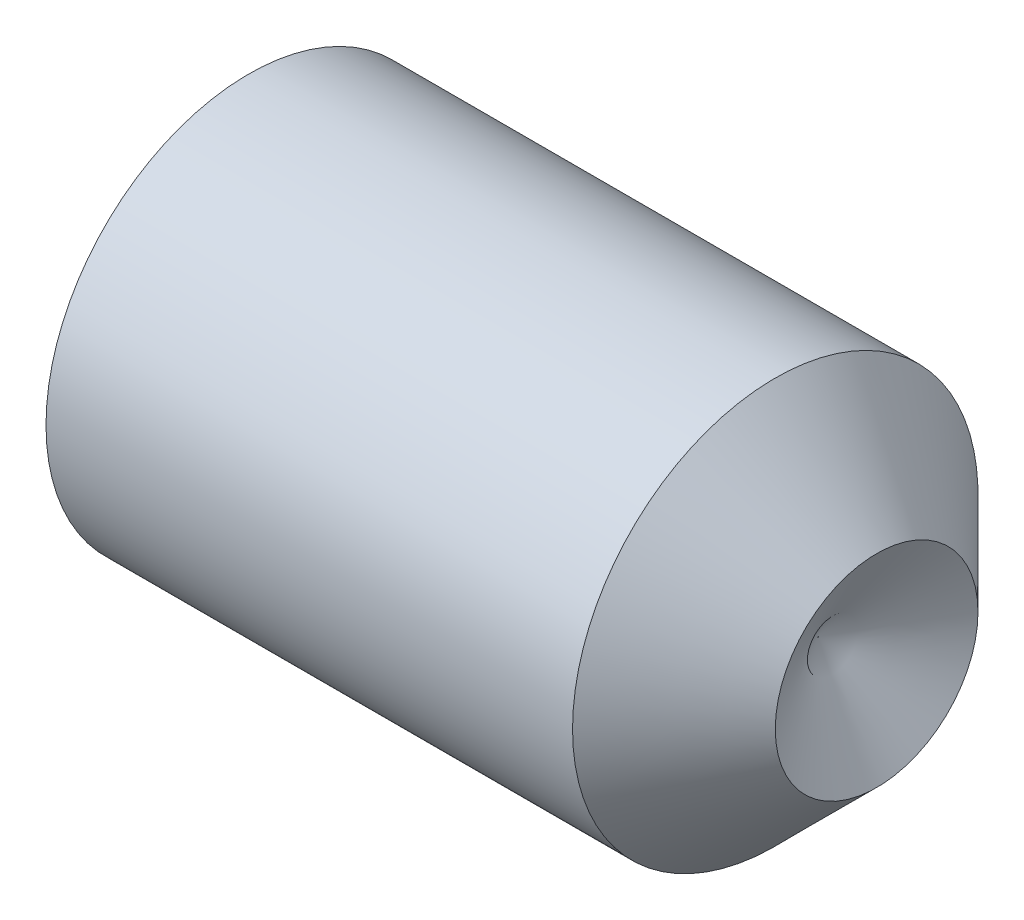
ISO-10303-21;
HEADER;
FILE_DESCRIPTION(('STEP AP214'),'2;1');
FILE_NAME('part.step','',(''),(''),'','','');
FILE_SCHEMA(('AUTOMOTIVE_DESIGN { 1 0 10303 214 1 1 1 1 }'));
ENDSEC;
DATA;
#1=APPLICATION_CONTEXT('core data for automotive mechanical design processes');
#2=APPLICATION_PROTOCOL_DEFINITION('international standard','automotive_design',2000,#1);
#3=PRODUCT_CONTEXT('',#1,'mechanical');
#4=PRODUCT('Part','Part','',(#3));
#5=PRODUCT_RELATED_PRODUCT_CATEGORY('part','',(#4));
#6=PRODUCT_DEFINITION_FORMATION('','',#4);
#7=PRODUCT_DEFINITION_CONTEXT('part definition',#1,'design');
#8=PRODUCT_DEFINITION('design','',#6,#7);
#9=PRODUCT_DEFINITION_SHAPE('','',#8);
#10=(LENGTH_UNIT() NAMED_UNIT(*) SI_UNIT(.MILLI.,.METRE.));
#11=(NAMED_UNIT(*) PLANE_ANGLE_UNIT() SI_UNIT($,.RADIAN.));
#12=(NAMED_UNIT(*) SI_UNIT($,.STERADIAN.) SOLID_ANGLE_UNIT());
#13=UNCERTAINTY_MEASURE_WITH_UNIT(LENGTH_MEASURE(1.E-05),#10,'distance_accuracy_value','');
#14=(GEOMETRIC_REPRESENTATION_CONTEXT(3) GLOBAL_UNCERTAINTY_ASSIGNED_CONTEXT((#13)) GLOBAL_UNIT_ASSIGNED_CONTEXT((#10,
#11,#12)) REPRESENTATION_CONTEXT('',''));
#15=CARTESIAN_POINT('',(0.,0.,0.));
#16=DIRECTION('',(0.,0.,1.));
#17=DIRECTION('',(1.,0.,0.));
#18=AXIS2_PLACEMENT_3D('',#15,#16,#17);
#19=CARTESIAN_POINT('',(0.,0.,0.));
#20=DIRECTION('',(-1.,0.,0.));
#21=DIRECTION('',(0.,0.,1.));
#22=AXIS2_PLACEMENT_3D('',#19,#20,#21);
#23=PLANE('',#22);
#24=CARTESIAN_POINT('',(0.,0.,0.));
#25=DIRECTION('',(-1.,0.,0.));
#26=DIRECTION('',(0.,0.,1.));
#27=AXIS2_PLACEMENT_3D('',#24,#25,#26);
#28=CIRCLE('',#27,2.055);
#29=CARTESIAN_POINT('',(0.,0.,2.055));
#30=VERTEX_POINT('',#29);
#31=EDGE_CURVE('E11',#30,#30,#28,.T.);
#32=ORIENTED_EDGE('',*,*,#31,.T.);
#33=EDGE_LOOP('',(#32));
#34=FACE_BOUND('',#33,.T.);
#35=DIRECTION('',(0.,0.,-1.));
#36=VECTOR('',#35,1.);
#37=CARTESIAN_POINT('',(0.,1.25,0.72168783648703));
#38=LINE('',#37,#36);
#39=CARTESIAN_POINT('',(0.,1.25,0.72168783648703));
#40=VERTEX_POINT('',#39);
#41=CARTESIAN_POINT('',(0.,1.25,-0.721687836487035));
#42=VERTEX_POINT('',#41);
#43=EDGE_CURVE('E95',#40,#42,#38,.T.);
#44=ORIENTED_EDGE('',*,*,#43,.F.);
#45=DIRECTION('',(0.,-0.866025403784439,0.5));
#46=VECTOR('',#45,1.);
#47=CARTESIAN_POINT('',(0.,1.25,0.72168783648703));
#48=LINE('',#47,#46);
#49=CARTESIAN_POINT('',(0.,0.,1.44337567297406));
#50=VERTEX_POINT('',#49);
#51=EDGE_CURVE('E48',#40,#50,#48,.T.);
#52=ORIENTED_EDGE('',*,*,#51,.T.);
#53=DIRECTION('',(0.,0.866025403784439,0.5));
#54=VECTOR('',#53,1.);
#55=CARTESIAN_POINT('',(0.,-1.25,0.72168783648703));
#56=LINE('',#55,#54);
#57=CARTESIAN_POINT('',(0.,-1.25,0.72168783648703));
#58=VERTEX_POINT('',#57);
#59=EDGE_CURVE('E101',#58,#50,#56,.T.);
#60=ORIENTED_EDGE('',*,*,#59,.F.);
#61=DIRECTION('',(0.,0.,-1.));
#62=VECTOR('',#61,1.);
#63=CARTESIAN_POINT('',(0.,-1.25,0.72168783648703));
#64=LINE('',#63,#62);
#65=CARTESIAN_POINT('',(0.,-1.25,-0.721687836487035));
#66=VERTEX_POINT('',#65);
#67=EDGE_CURVE('E121',#58,#66,#64,.T.);
#68=ORIENTED_EDGE('',*,*,#67,.T.);
#69=DIRECTION('',(0.,0.866025403784439,-0.5));
#70=VECTOR('',#69,1.);
#71=CARTESIAN_POINT('',(0.,-1.25,-0.721687836487035));
#72=LINE('',#71,#70);
#73=CARTESIAN_POINT('',(0.,0.,-1.44337567297407));
#74=VERTEX_POINT('',#73);
#75=EDGE_CURVE('E124',#66,#74,#72,.T.);
#76=ORIENTED_EDGE('',*,*,#75,.T.);
#77=DIRECTION('',(0.,-0.866025403784439,-0.5));
#78=VECTOR('',#77,1.);
#79=CARTESIAN_POINT('',(0.,1.25,-0.721687836487035));
#80=LINE('',#79,#78);
#81=EDGE_CURVE('E127',#42,#74,#80,.T.);
#82=ORIENTED_EDGE('',*,*,#81,.F.);
#83=EDGE_LOOP('',(#44,#52,#60,#68,#76,#82));
#84=FACE_BOUND('',#83,.T.);
#85=ADVANCED_FACE('F34',(#34,#84),#23,.T.);
#86=CARTESIAN_POINT('',(0.,0.,0.));
#87=DIRECTION('',(1.,0.,0.));
#88=DIRECTION('',(0.,0.,-1.));
#89=AXIS2_PLACEMENT_3D('',#86,#87,#88);
#90=CONICAL_SURFACE('',#89,2.055,1.0471975511966);
#91=CARTESIAN_POINT('',(0.256920869789384,0.,0.));
#92=DIRECTION('',(-1.,0.,0.));
#93=DIRECTION('',(0.,0.,1.));
#94=AXIS2_PLACEMENT_3D('',#91,#92,#93);
#95=CIRCLE('',#94,2.5);
#96=CARTESIAN_POINT('',(0.256920869789384,0.,2.5));
#97=VERTEX_POINT('',#96);
#98=EDGE_CURVE('E41',#97,#97,#95,.T.);
#99=ORIENTED_EDGE('',*,*,#98,.T.);
#100=EDGE_LOOP('',(#99));
#101=FACE_BOUND('',#100,.T.);
#102=ORIENTED_EDGE('',*,*,#31,.F.);
#103=EDGE_LOOP('',(#102));
#104=FACE_BOUND('',#103,.T.);
#105=ADVANCED_FACE('F147',(#101,#104),#90,.T.);
#106=CARTESIAN_POINT('',(-12.7,0.,0.));
#107=DIRECTION('',(-1.,0.,0.));
#108=DIRECTION('',(0.,0.,1.));
#109=AXIS2_PLACEMENT_3D('',#106,#107,#108);
#110=CYLINDRICAL_SURFACE('',#109,2.5);
#111=CARTESIAN_POINT('',(6.75000000000003,0.,0.));
#112=DIRECTION('',(-1.,0.,0.));
#113=DIRECTION('',(0.,0.,1.));
#114=AXIS2_PLACEMENT_3D('',#111,#112,#113);
#115=CIRCLE('',#114,2.5);
#116=CARTESIAN_POINT('',(6.75000000000003,0.,2.5));
#117=VERTEX_POINT('',#116);
#118=EDGE_CURVE('E142',#117,#117,#115,.T.);
#119=ORIENTED_EDGE('',*,*,#118,.T.);
#120=EDGE_LOOP('',(#119));
#121=FACE_BOUND('',#120,.T.);
#122=ORIENTED_EDGE('',*,*,#98,.F.);
#123=EDGE_LOOP('',(#122));
#124=FACE_BOUND('',#123,.T.);
#125=ADVANCED_FACE('F150',(#121,#124),#110,.T.);
#126=CARTESIAN_POINT('',(6.75000000000003,0.,0.));
#127=DIRECTION('',(-1.,0.,0.));
#128=DIRECTION('',(0.,0.,1.));
#129=AXIS2_PLACEMENT_3D('',#126,#127,#128);
#130=CONICAL_SURFACE('',#129,2.5,0.785398163397459);
#131=CARTESIAN_POINT('',(8.,0.,0.));
#132=DIRECTION('',(-1.,0.,0.));
#133=DIRECTION('',(0.,0.,1.));
#134=AXIS2_PLACEMENT_3D('',#131,#132,#133);
#135=CIRCLE('',#134,1.25);
#136=CARTESIAN_POINT('',(8.,0.,1.25));
#137=VERTEX_POINT('',#136);
#138=EDGE_CURVE('E102',#137,#137,#135,.T.);
#139=ORIENTED_EDGE('',*,*,#138,.T.);
#140=EDGE_LOOP('',(#139));
#141=FACE_BOUND('',#140,.T.);
#142=ORIENTED_EDGE('',*,*,#118,.F.);
#143=EDGE_LOOP('',(#142));
#144=FACE_BOUND('',#143,.T.);
#145=ADVANCED_FACE('F152',(#141,#144),#130,.T.);
#146=CARTESIAN_POINT('',(7.27831216351297,0.,0.));
#147=DIRECTION('',(1.,0.,0.));
#148=DIRECTION('',(0.,0.,-1.));
#149=AXIS2_PLACEMENT_3D('',#146,#147,#148);
#150=CONICAL_SURFACE('',#149,0.,1.0471975511966);
#151=ORIENTED_EDGE('',*,*,#138,.F.);
#152=EDGE_LOOP('',(#151));
#153=FACE_BOUND('',#152,.T.);
#154=CARTESIAN_POINT('',(7.27831216351297,0.,0.));
#155=VERTEX_POINT('',#154);
#156=VERTEX_LOOP('',#155);
#157=FACE_BOUND('',#156,.T.);
#158=ADVANCED_FACE('F159',(#153,#157),#150,.F.);
#159=CARTESIAN_POINT('',(3.,1.25,0.72168783648703));
#160=DIRECTION('',(0.,-0.5,-0.866025403784439));
#161=DIRECTION('',(0.,0.866025403784439,-0.5));
#162=AXIS2_PLACEMENT_3D('',#159,#160,#161);
#163=PLANE('',#162);
#164=ORIENTED_EDGE('',*,*,#51,.F.);
#165=DIRECTION('',(-1.,0.,0.));
#166=VECTOR('',#165,1.);
#167=CARTESIAN_POINT('',(3.,1.25,0.72168783648703));
#168=LINE('',#167,#166);
#169=CARTESIAN_POINT('',(3.,1.25,0.72168783648703));
#170=VERTEX_POINT('',#169);
#171=EDGE_CURVE('E89',#170,#40,#168,.T.);
#172=ORIENTED_EDGE('',*,*,#171,.F.);
#173=DIRECTION('',(0.,-0.866025403784439,0.5));
#174=VECTOR('',#173,1.);
#175=CARTESIAN_POINT('',(3.,1.25,0.72168783648703));
#176=LINE('',#175,#174);
#177=CARTESIAN_POINT('',(3.,0.,1.44337567297406));
#178=VERTEX_POINT('',#177);
#179=EDGE_CURVE('E84',#170,#178,#176,.T.);
#180=ORIENTED_EDGE('',*,*,#179,.T.);
#181=DIRECTION('',(-1.,0.,0.));
#182=VECTOR('',#181,1.);
#183=CARTESIAN_POINT('',(3.,0.,1.44337567297406));
#184=LINE('',#183,#182);
#185=EDGE_CURVE('E87',#178,#50,#184,.T.);
#186=ORIENTED_EDGE('',*,*,#185,.T.);
#187=EDGE_LOOP('',(#164,#172,#180,#186));
#188=FACE_BOUND('',#187,.T.);
#189=ADVANCED_FACE('F86',(#188),#163,.T.);
#190=CARTESIAN_POINT('',(3.,-1.25,0.72168783648703));
#191=DIRECTION('',(0.,-0.5,0.866025403784439));
#192=DIRECTION('',(0.,-0.866025403784439,-0.5));
#193=AXIS2_PLACEMENT_3D('',#190,#191,#192);
#194=PLANE('',#193);
#195=ORIENTED_EDGE('',*,*,#59,.T.);
#196=ORIENTED_EDGE('',*,*,#185,.F.);
#197=DIRECTION('',(0.,0.866025403784439,0.5));
#198=VECTOR('',#197,1.);
#199=CARTESIAN_POINT('',(3.,-1.25,0.72168783648703));
#200=LINE('',#199,#198);
#201=CARTESIAN_POINT('',(3.,-1.25,0.72168783648703));
#202=VERTEX_POINT('',#201);
#203=EDGE_CURVE('E94',#202,#178,#200,.T.);
#204=ORIENTED_EDGE('',*,*,#203,.F.);
#205=DIRECTION('',(-1.,0.,0.));
#206=VECTOR('',#205,1.);
#207=CARTESIAN_POINT('',(3.,-1.25,0.72168783648703));
#208=LINE('',#207,#206);
#209=EDGE_CURVE('E103',#202,#58,#208,.T.);
#210=ORIENTED_EDGE('',*,*,#209,.T.);
#211=EDGE_LOOP('',(#195,#196,#204,#210));
#212=FACE_BOUND('',#211,.T.);
#213=ADVANCED_FACE('F99',(#212),#194,.F.);
#214=CARTESIAN_POINT('',(3.,-1.25,0.72168783648703));
#215=DIRECTION('',(0.,1.,0.));
#216=DIRECTION('',(0.,0.,1.));
#217=AXIS2_PLACEMENT_3D('',#214,#215,#216);
#218=PLANE('',#217);
#219=ORIENTED_EDGE('',*,*,#67,.F.);
#220=ORIENTED_EDGE('',*,*,#209,.F.);
#221=DIRECTION('',(0.,0.,-1.));
#222=VECTOR('',#221,1.);
#223=CARTESIAN_POINT('',(3.,-1.25,0.72168783648703));
#224=LINE('',#223,#222);
#225=CARTESIAN_POINT('',(3.,-1.25,-0.721687836487035));
#226=VERTEX_POINT('',#225);
#227=EDGE_CURVE('E108',#202,#226,#224,.T.);
#228=ORIENTED_EDGE('',*,*,#227,.T.);
#229=DIRECTION('',(-1.,0.,0.));
#230=VECTOR('',#229,1.);
#231=CARTESIAN_POINT('',(3.,-1.25,-0.721687836487035));
#232=LINE('',#231,#230);
#233=EDGE_CURVE('E137',#226,#66,#232,.T.);
#234=ORIENTED_EDGE('',*,*,#233,.T.);
#235=EDGE_LOOP('',(#219,#220,#228,#234));
#236=FACE_BOUND('',#235,.T.);
#237=ADVANCED_FACE('F182',(#236),#218,.T.);
#238=CARTESIAN_POINT('',(3.,-1.25,-0.721687836487035));
#239=DIRECTION('',(0.,0.5,0.866025403784439));
#240=DIRECTION('',(0.,-0.866025403784439,0.5));
#241=AXIS2_PLACEMENT_3D('',#238,#239,#240);
#242=PLANE('',#241);
#243=ORIENTED_EDGE('',*,*,#75,.F.);
#244=ORIENTED_EDGE('',*,*,#233,.F.);
#245=DIRECTION('',(0.,0.866025403784439,-0.5));
#246=VECTOR('',#245,1.);
#247=CARTESIAN_POINT('',(3.,-1.25,-0.721687836487035));
#248=LINE('',#247,#246);
#249=CARTESIAN_POINT('',(3.,0.,-1.44337567297407));
#250=VERTEX_POINT('',#249);
#251=EDGE_CURVE('E110',#226,#250,#248,.T.);
#252=ORIENTED_EDGE('',*,*,#251,.T.);
#253=DIRECTION('',(-1.,0.,0.));
#254=VECTOR('',#253,1.);
#255=CARTESIAN_POINT('',(3.,0.,-1.44337567297407));
#256=LINE('',#255,#254);
#257=EDGE_CURVE('E135',#250,#74,#256,.T.);
#258=ORIENTED_EDGE('',*,*,#257,.T.);
#259=EDGE_LOOP('',(#243,#244,#252,#258));
#260=FACE_BOUND('',#259,.T.);
#261=ADVANCED_FACE('F178',(#260),#242,.T.);
#262=CARTESIAN_POINT('',(3.,1.25,-0.721687836487035));
#263=DIRECTION('',(0.,0.5,-0.866025403784438));
#264=DIRECTION('',(0.,0.866025403784439,0.5));
#265=AXIS2_PLACEMENT_3D('',#262,#263,#264);
#266=PLANE('',#265);
#267=ORIENTED_EDGE('',*,*,#81,.T.);
#268=ORIENTED_EDGE('',*,*,#257,.F.);
#269=DIRECTION('',(0.,-0.866025403784439,-0.5));
#270=VECTOR('',#269,1.);
#271=CARTESIAN_POINT('',(3.,1.25,-0.721687836487035));
#272=LINE('',#271,#270);
#273=CARTESIAN_POINT('',(3.,1.25,-0.721687836487035));
#274=VERTEX_POINT('',#273);
#275=EDGE_CURVE('E114',#274,#250,#272,.T.);
#276=ORIENTED_EDGE('',*,*,#275,.F.);
#277=DIRECTION('',(-1.,0.,0.));
#278=VECTOR('',#277,1.);
#279=CARTESIAN_POINT('',(3.,1.25,-0.721687836487035));
#280=LINE('',#279,#278);
#281=EDGE_CURVE('E133',#274,#42,#280,.T.);
#282=ORIENTED_EDGE('',*,*,#281,.T.);
#283=EDGE_LOOP('',(#267,#268,#276,#282));
#284=FACE_BOUND('',#283,.T.);
#285=ADVANCED_FACE('F175',(#284),#266,.F.);
#286=CARTESIAN_POINT('',(3.,1.25,0.72168783648703));
#287=DIRECTION('',(0.,1.,0.));
#288=DIRECTION('',(0.,0.,1.));
#289=AXIS2_PLACEMENT_3D('',#286,#287,#288);
#290=PLANE('',#289);
#291=ORIENTED_EDGE('',*,*,#43,.T.);
#292=ORIENTED_EDGE('',*,*,#281,.F.);
#293=DIRECTION('',(0.,0.,-1.));
#294=VECTOR('',#293,1.);
#295=CARTESIAN_POINT('',(3.,1.25,0.72168783648703));
#296=LINE('',#295,#294);
#297=EDGE_CURVE('E117',#170,#274,#296,.T.);
#298=ORIENTED_EDGE('',*,*,#297,.F.);
#299=ORIENTED_EDGE('',*,*,#171,.T.);
#300=EDGE_LOOP('',(#291,#292,#298,#299));
#301=FACE_BOUND('',#300,.T.);
#302=ADVANCED_FACE('F171',(#301),#290,.F.);
#303=CARTESIAN_POINT('',(3.,1.25,0.72168783648703));
#304=DIRECTION('',(1.,0.,0.));
#305=DIRECTION('',(0.,0.,-1.));
#306=AXIS2_PLACEMENT_3D('',#303,#304,#305);
#307=PLANE('',#306);
#308=ORIENTED_EDGE('',*,*,#179,.F.);
#309=ORIENTED_EDGE('',*,*,#297,.T.);
#310=ORIENTED_EDGE('',*,*,#275,.T.);
#311=ORIENTED_EDGE('',*,*,#251,.F.);
#312=ORIENTED_EDGE('',*,*,#227,.F.);
#313=ORIENTED_EDGE('',*,*,#203,.T.);
#314=EDGE_LOOP('',(#308,#309,#310,#311,#312,#313));
#315=FACE_BOUND('',#314,.T.);
#316=ADVANCED_FACE('F106',(#315),#307,.F.);
#317=CLOSED_SHELL('',(#85,#105,#125,#145,#158,#189,#213,#237,#261,#285,#302,#316));
#318=MANIFOLD_SOLID_BREP('B2',#317);
#319=ADVANCED_BREP_SHAPE_REPRESENTATION('',(#18,#318),#14);
#320=SHAPE_DEFINITION_REPRESENTATION(#9,#319);
ENDSEC;
END-ISO-10303-21;
